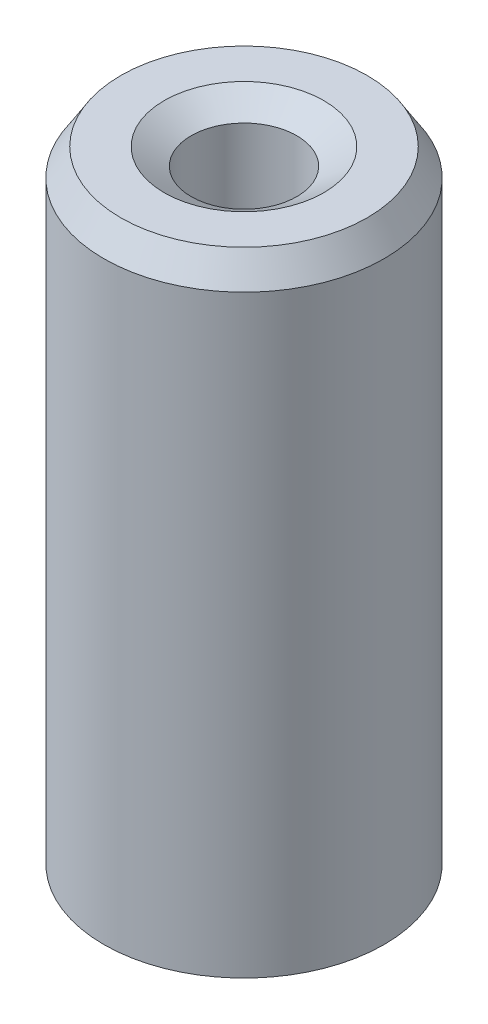
ISO-10303-21;
HEADER;
FILE_DESCRIPTION(('STEP AP214'),'2;1');
FILE_NAME('part.step','',(''),(''),'','','');
FILE_SCHEMA(('AUTOMOTIVE_DESIGN { 1 0 10303 214 1 1 1 1 }'));
ENDSEC;
DATA;
#1=APPLICATION_CONTEXT('core data for automotive mechanical design processes');
#2=APPLICATION_PROTOCOL_DEFINITION('international standard','automotive_design',2000,#1);
#3=PRODUCT_CONTEXT('',#1,'mechanical');
#4=PRODUCT('Part','Part','',(#3));
#5=PRODUCT_RELATED_PRODUCT_CATEGORY('part','',(#4));
#6=PRODUCT_DEFINITION_FORMATION('','',#4);
#7=PRODUCT_DEFINITION_CONTEXT('part definition',#1,'design');
#8=PRODUCT_DEFINITION('design','',#6,#7);
#9=PRODUCT_DEFINITION_SHAPE('','',#8);
#10=(LENGTH_UNIT() NAMED_UNIT(*) SI_UNIT(.MILLI.,.METRE.));
#11=(NAMED_UNIT(*) PLANE_ANGLE_UNIT() SI_UNIT($,.RADIAN.));
#12=(NAMED_UNIT(*) SI_UNIT($,.STERADIAN.) SOLID_ANGLE_UNIT());
#13=UNCERTAINTY_MEASURE_WITH_UNIT(LENGTH_MEASURE(1.E-05),#10,'distance_accuracy_value','');
#14=(GEOMETRIC_REPRESENTATION_CONTEXT(3) GLOBAL_UNCERTAINTY_ASSIGNED_CONTEXT((#13)) GLOBAL_UNIT_ASSIGNED_CONTEXT((#10,
#11,#12)) REPRESENTATION_CONTEXT('',''));
#15=CARTESIAN_POINT('',(0.,0.,0.));
#16=DIRECTION('',(0.,0.,1.));
#17=DIRECTION('',(1.,0.,0.));
#18=AXIS2_PLACEMENT_3D('',#15,#16,#17);
#19=CARTESIAN_POINT('',(0.,56.8937532098877,0.));
#20=DIRECTION('',(0.,-1.,0.));
#21=DIRECTION('',(0.,0.,-1.));
#22=AXIS2_PLACEMENT_3D('',#19,#20,#21);
#23=CYLINDRICAL_SURFACE('',#22,12.5);
#24=CARTESIAN_POINT('',(0.,1.50808225070241,0.));
#25=DIRECTION('',(0.,1.,0.));
#26=DIRECTION('',(0.,0.,1.));
#27=AXIS2_PLACEMENT_3D('',#24,#25,#26);
#28=CIRCLE('',#27,12.5);
#29=CARTESIAN_POINT('',(0.,1.50808225070241,12.5));
#30=VERTEX_POINT('',#29);
#31=EDGE_CURVE('E10',#30,#30,#28,.T.);
#32=ORIENTED_EDGE('',*,*,#31,.T.);
#33=EDGE_LOOP('',(#32));
#34=FACE_BOUND('',#33,.T.);
#35=CARTESIAN_POINT('',(0.,54.4863640051039,0.));
#36=DIRECTION('',(0.,1.,0.));
#37=DIRECTION('',(0.,0.,1.));
#38=AXIS2_PLACEMENT_3D('',#35,#36,#37);
#39=CIRCLE('',#38,12.5);
#40=CARTESIAN_POINT('',(0.,54.4863640051039,12.5));
#41=VERTEX_POINT('',#40);
#42=EDGE_CURVE('E50',#41,#41,#39,.F.);
#43=ORIENTED_EDGE('',*,*,#42,.T.);
#44=EDGE_LOOP('',(#43));
#45=FACE_BOUND('',#44,.T.);
#46=ADVANCED_FACE('F39',(#34,#45),#23,.T.);
#47=CARTESIAN_POINT('',(0.,56.8937532098877,0.));
#48=DIRECTION('',(0.,1.,0.));
#49=DIRECTION('',(0.,0.,1.));
#50=AXIS2_PLACEMENT_3D('',#47,#48,#49);
#51=PLANE('',#50);
#52=CARTESIAN_POINT('',(0.,56.8937532098877,0.));
#53=DIRECTION('',(0.,1.,0.));
#54=DIRECTION('',(0.,0.,1.));
#55=AXIS2_PLACEMENT_3D('',#52,#53,#54);
#56=CIRCLE('',#55,7.1188980291708);
#57=CARTESIAN_POINT('',(0.,56.8937532098877,7.1188980291708));
#58=VERTEX_POINT('',#57);
#59=EDGE_CURVE('E58',#58,#58,#56,.F.);
#60=ORIENTED_EDGE('',*,*,#59,.T.);
#61=EDGE_LOOP('',(#60));
#62=FACE_BOUND('',#61,.T.);
#63=CARTESIAN_POINT('',(0.,56.8937532098877,0.));
#64=DIRECTION('',(0.,1.,0.));
#65=DIRECTION('',(0.,0.,1.));
#66=AXIS2_PLACEMENT_3D('',#63,#64,#65);
#67=CIRCLE('',#66,10.9919177492976);
#68=CARTESIAN_POINT('',(0.,56.8937532098877,10.9919177492976));
#69=VERTEX_POINT('',#68);
#70=EDGE_CURVE('E61',#69,#69,#67,.T.);
#71=ORIENTED_EDGE('',*,*,#70,.T.);
#72=EDGE_LOOP('',(#71));
#73=FACE_BOUND('',#72,.T.);
#74=ADVANCED_FACE('F88',(#62,#73),#51,.T.);
#75=CARTESIAN_POINT('',(0.,0.,0.));
#76=DIRECTION('',(0.,1.,0.));
#77=DIRECTION('',(0.,0.,1.));
#78=AXIS2_PLACEMENT_3D('',#75,#76,#77);
#79=PLANE('',#78);
#80=CARTESIAN_POINT('',(0.,0.,0.));
#81=DIRECTION('',(0.,1.,0.));
#82=DIRECTION('',(0.,0.,1.));
#83=AXIS2_PLACEMENT_3D('',#80,#81,#82);
#84=CIRCLE('',#83,6.21959107508939);
#85=CARTESIAN_POINT('',(0.,0.,6.21959107508939));
#86=VERTEX_POINT('',#85);
#87=EDGE_CURVE('E51',#86,#86,#84,.T.);
#88=ORIENTED_EDGE('',*,*,#87,.T.);
#89=EDGE_LOOP('',(#88));
#90=FACE_BOUND('',#89,.T.);
#91=CARTESIAN_POINT('',(0.,0.,0.));
#92=DIRECTION('',(0.,1.,0.));
#93=DIRECTION('',(0.,0.,1.));
#94=AXIS2_PLACEMENT_3D('',#91,#92,#93);
#95=CIRCLE('',#94,10.0926107952162);
#96=CARTESIAN_POINT('',(0.,0.,10.0926107952162));
#97=VERTEX_POINT('',#96);
#98=EDGE_CURVE('E54',#97,#97,#95,.F.);
#99=ORIENTED_EDGE('',*,*,#98,.T.);
#100=EDGE_LOOP('',(#99));
#101=FACE_BOUND('',#100,.T.);
#102=ADVANCED_FACE('F83',(#90,#101),#79,.F.);
#103=CARTESIAN_POINT('',(0.,56.8937532098877,0.));
#104=DIRECTION('',(0.,-1.,0.));
#105=DIRECTION('',(0.,0.,-1.));
#106=AXIS2_PLACEMENT_3D('',#103,#104,#105);
#107=CYLINDRICAL_SURFACE('',#106,4.71150882438697);
#108=CARTESIAN_POINT('',(0.,55.3856709591853,0.));
#109=DIRECTION('',(0.,1.,0.));
#110=DIRECTION('',(0.,0.,1.));
#111=AXIS2_PLACEMENT_3D('',#108,#109,#110);
#112=CIRCLE('',#111,4.71150882438697);
#113=CARTESIAN_POINT('',(0.,55.3856709591853,4.71150882438697));
#114=VERTEX_POINT('',#113);
#115=EDGE_CURVE('E67',#114,#114,#112,.T.);
#116=ORIENTED_EDGE('',*,*,#115,.T.);
#117=EDGE_LOOP('',(#116));
#118=FACE_BOUND('',#117,.T.);
#119=CARTESIAN_POINT('',(0.,2.40738920478382,0.));
#120=DIRECTION('',(0.,1.,0.));
#121=DIRECTION('',(0.,0.,1.));
#122=AXIS2_PLACEMENT_3D('',#119,#120,#121);
#123=CIRCLE('',#122,4.71150882438697);
#124=CARTESIAN_POINT('',(0.,2.40738920478382,4.71150882438697));
#125=VERTEX_POINT('',#124);
#126=EDGE_CURVE('E69',#125,#125,#123,.F.);
#127=ORIENTED_EDGE('',*,*,#126,.T.);
#128=EDGE_LOOP('',(#127));
#129=FACE_BOUND('',#128,.T.);
#130=ADVANCED_FACE('F71',(#118,#129),#107,.F.);
#131=CARTESIAN_POINT('',(0.,55.3856709591853,0.));
#132=DIRECTION('',(0.,1.,0.));
#133=DIRECTION('',(0.,0.,1.));
#134=AXIS2_PLACEMENT_3D('',#131,#132,#133);
#135=CONICAL_SURFACE('',#134,4.71150882438697,1.01116296432046);
#136=ORIENTED_EDGE('',*,*,#59,.F.);
#137=EDGE_LOOP('',(#136));
#138=FACE_BOUND('',#137,.T.);
#139=ORIENTED_EDGE('',*,*,#115,.F.);
#140=EDGE_LOOP('',(#139));
#141=FACE_BOUND('',#140,.T.);
#142=ADVANCED_FACE('F77',(#138,#141),#135,.F.);
#143=CARTESIAN_POINT('',(0.,0.,0.));
#144=DIRECTION('',(0.,-1.,0.));
#145=DIRECTION('',(0.,0.,-1.));
#146=AXIS2_PLACEMENT_3D('',#143,#144,#145);
#147=CONICAL_SURFACE('',#146,6.21959107508939,0.559633362474437);
#148=ORIENTED_EDGE('',*,*,#126,.F.);
#149=EDGE_LOOP('',(#148));
#150=FACE_BOUND('',#149,.T.);
#151=ORIENTED_EDGE('',*,*,#87,.F.);
#152=EDGE_LOOP('',(#151));
#153=FACE_BOUND('',#152,.T.);
#154=ADVANCED_FACE('F73',(#150,#153),#147,.F.);
#155=CARTESIAN_POINT('',(0.,1.50808225070241,0.));
#156=DIRECTION('',(0.,1.,0.));
#157=DIRECTION('',(0.,0.,1.));
#158=AXIS2_PLACEMENT_3D('',#155,#156,#157);
#159=CONICAL_SURFACE('',#158,12.5,1.01116296432046);
#160=CARTESIAN_POINT('',(0.,0.,10.0926107952162));
#161=CARTESIAN_POINT('',(0.,0.015709190111483,10.1176877660994));
#162=CARTESIAN_POINT('',(0.,0.0314183802229666,10.1427647369825));
#163=CARTESIAN_POINT('',(0.,0.0628367604459337,10.1929186787489));
#164=CARTESIAN_POINT('',(0.,0.0785459505574172,10.217995649632));
#165=CARTESIAN_POINT('',(0.,0.109964330780384,10.2681495913983));
#166=CARTESIAN_POINT('',(0.,0.125673520891867,10.2932265622815));
#167=CARTESIAN_POINT('',(0.,0.157091901114834,10.3433805040478));
#168=CARTESIAN_POINT('',(0.,0.172801091226318,10.368457474931));
#169=CARTESIAN_POINT('',(0.,0.204219471449285,10.4186114166973));
#170=CARTESIAN_POINT('',(0.,0.219928661560768,10.4436883875805));
#171=CARTESIAN_POINT('',(0.,0.251347041783735,10.4938423293468));
#172=CARTESIAN_POINT('',(0.,0.267056231895218,10.51891930023));
#173=CARTESIAN_POINT('',(0.,0.298474612118185,10.5690732419963));
#174=CARTESIAN_POINT('',(0.,0.314183802229669,10.5941502128795));
#175=CARTESIAN_POINT('',(0.,0.345602182452636,10.6443041546458));
#176=CARTESIAN_POINT('',(0.,0.361311372564119,10.669381125529));
#177=CARTESIAN_POINT('',(0.,0.392729752787086,10.7195350672953));
#178=CARTESIAN_POINT('',(0.,0.40843894289857,10.7446120381785));
#179=CARTESIAN_POINT('',(0.,0.439857323121536,10.7947659799448));
#180=CARTESIAN_POINT('',(0.,0.45556651323302,10.819842950828));
#181=CARTESIAN_POINT('',(0.,0.486984893455987,10.8699968925943));
#182=CARTESIAN_POINT('',(0.,0.50269408356747,10.8950738634775));
#183=CARTESIAN_POINT('',(0.,0.534112463790437,10.9452278052438));
#184=CARTESIAN_POINT('',(0.,0.549821653901921,10.970304776127));
#185=CARTESIAN_POINT('',(0.,0.581240034124887,11.0204587178933));
#186=CARTESIAN_POINT('',(0.,0.596949224236371,11.0455356887765));
#187=CARTESIAN_POINT('',(0.,0.628367604459338,11.0956896305428));
#188=CARTESIAN_POINT('',(0.,0.644076794570821,11.1207666014259));
#189=CARTESIAN_POINT('',(0.,0.675495174793788,11.1709205431923));
#190=CARTESIAN_POINT('',(0.,0.691204364905272,11.1959975140754));
#191=CARTESIAN_POINT('',(0.,0.722622745128239,11.2461514558418));
#192=CARTESIAN_POINT('',(0.,0.738331935239722,11.2712284267249));
#193=CARTESIAN_POINT('',(0.,0.769750315462689,11.3213823684913));
#194=CARTESIAN_POINT('',(0.,0.785459505574172,11.3464593393744));
#195=CARTESIAN_POINT('',(0.,0.816877885797139,11.3966132811408));
#196=CARTESIAN_POINT('',(0.,0.832587075908623,11.4216902520239));
#197=CARTESIAN_POINT('',(0.,0.864005456131589,11.4718441937903));
#198=CARTESIAN_POINT('',(0.,0.879714646243073,11.4969211646734));
#199=CARTESIAN_POINT('',(0.,0.91113302646604,11.5470751064397));
#200=CARTESIAN_POINT('',(0.,0.926842216577524,11.5721520773229));
#201=CARTESIAN_POINT('',(0.,0.95826059680049,11.6223060190892));
#202=CARTESIAN_POINT('',(0.,0.973969786911974,11.6473829899724));
#203=CARTESIAN_POINT('',(0.,1.00538816713494,11.6975369317387));
#204=CARTESIAN_POINT('',(0.,1.02109735724642,11.7226139026219));
#205=CARTESIAN_POINT('',(0.,1.05251573746939,11.7727678443882));
#206=CARTESIAN_POINT('',(0.,1.06822492758087,11.7978448152714));
#207=CARTESIAN_POINT('',(0.,1.09964330780384,11.8479987570377));
#208=CARTESIAN_POINT('',(0.,1.11535249791532,11.8730757279209));
#209=CARTESIAN_POINT('',(0.,1.14677087813829,11.9232296696872));
#210=CARTESIAN_POINT('',(0.,1.16248006824977,11.9483066405704));
#211=CARTESIAN_POINT('',(0.,1.19389844847274,11.9984605823367));
#212=CARTESIAN_POINT('',(0.,1.20960763858423,12.0235375532199));
#213=CARTESIAN_POINT('',(0.,1.24102601880719,12.0736914949862));
#214=CARTESIAN_POINT('',(0.,1.25673520891868,12.0987684658694));
#215=CARTESIAN_POINT('',(0.,1.28815358914164,12.1489224076357));
#216=CARTESIAN_POINT('',(0.,1.30386277925313,12.1739993785189));
#217=CARTESIAN_POINT('',(0.,1.33528115947609,12.2241533202852));
#218=CARTESIAN_POINT('',(0.,1.35099034958758,12.2492302911684));
#219=CARTESIAN_POINT('',(0.,1.38240872981054,12.2993842329347));
#220=CARTESIAN_POINT('',(0.,1.39811791992203,12.3244612038178));
#221=CARTESIAN_POINT('',(0.,1.42953630014499,12.3746151455842));
#222=CARTESIAN_POINT('',(0.,1.44524549025648,12.3996921164673));
#223=CARTESIAN_POINT('',(0.,1.47666387047944,12.4498460582337));
#224=CARTESIAN_POINT('',(0.,1.49237306059093,12.4749230291168));
#225=CARTESIAN_POINT('',(0.,1.50808225070241,12.5));
#226=B_SPLINE_CURVE_WITH_KNOTS('',3,(#160,#161,#162,#163,#164,#165,#166,#167,#168,#169,#170,
#171,#172,#173,#174,#175,#176,#177,#178,#179,#180,#181,#182,#183,#184,#185,#186,#187,#188,#189,
#190,#191,#192,#193,#194,#195,#196,#197,#198,#199,#200,#201,#202,#203,#204,#205,#206,#207,#208,
#209,#210,#211,#212,#213,#214,#215,#216,#217,#218,#219,#220,#221,#222,#223,#224,#225),
.UNSPECIFIED.,.F.,.F.,(4,2,2,2,2,2,2,2,2,2,2,2,2,2,2,2,2,2,2,2,2,2,2,2,2,2,2,2,2,2,2,2,4),(0.,
0.0887732961182823,0.177546592236565,0.266319888354848,0.355093184473131,0.443866480591415,
0.532639776709697,0.621413072827979,0.710186368946263,0.798959665064546,0.887732961182829,
0.976506257301112,1.0652795534194,1.15405284953768,1.24282614565596,1.33159944177424,
1.42037273789253,1.50914603401081,1.59791933012909,1.68669262624738,1.77546592236566,
1.86423921848394,1.95301251460223,2.04178581072051,2.13055910683879,2.21933240295708,
2.30810569907536,2.39687899519364,2.48565229131192,2.57442558743021,2.66319888354849,
2.75197217966677,2.84074547578506),.UNSPECIFIED.);
#227=EDGE_CURVE('BSEAM76',#97,#30,#226,.T.);
#228=ORIENTED_EDGE('',*,*,#98,.F.);
#229=ORIENTED_EDGE('',*,*,#31,.F.);
#230=ORIENTED_EDGE('',*,*,#227,.T.);
#231=ORIENTED_EDGE('',*,*,#227,.F.);
#232=EDGE_LOOP('',(#228,#230,#229,#231));
#233=FACE_BOUND('',#232,.T.);
#234=ADVANCED_FACE('F76',(#233),#159,.T.);
#235=CARTESIAN_POINT('',(0.,56.8937532098877,0.));
#236=DIRECTION('',(0.,-1.,0.));
#237=DIRECTION('',(0.,0.,-1.));
#238=AXIS2_PLACEMENT_3D('',#235,#236,#237);
#239=CONICAL_SURFACE('',#238,10.9919177492976,0.559633362474437);
#240=ORIENTED_EDGE('',*,*,#42,.F.);
#241=EDGE_LOOP('',(#240));
#242=FACE_BOUND('',#241,.T.);
#243=ORIENTED_EDGE('',*,*,#70,.F.);
#244=EDGE_LOOP('',(#243));
#245=FACE_BOUND('',#244,.T.);
#246=ADVANCED_FACE('F45',(#242,#245),#239,.T.);
#247=CLOSED_SHELL('',(#46,#74,#102,#130,#142,#154,#234,#246));
#248=MANIFOLD_SOLID_BREP('B2',#247);
#249=ADVANCED_BREP_SHAPE_REPRESENTATION('',(#18,#248),#14);
#250=SHAPE_DEFINITION_REPRESENTATION(#9,#249);
ENDSEC;
END-ISO-10303-21;
